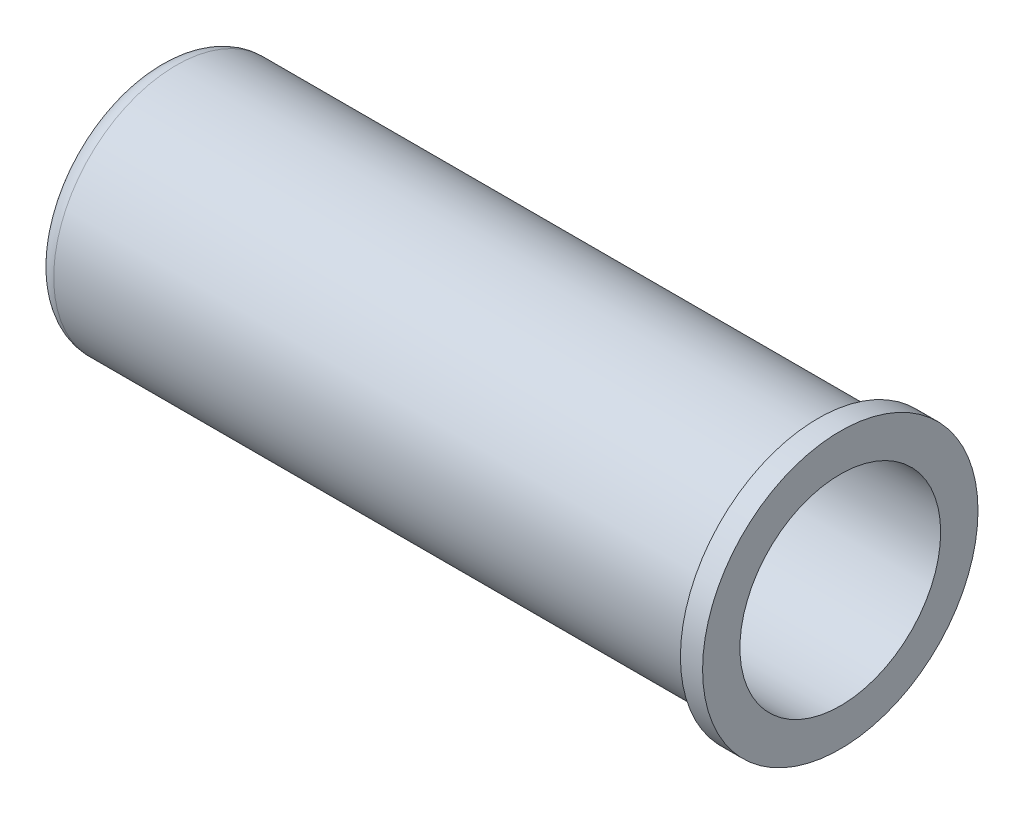
ISO-10303-21;
HEADER;
FILE_DESCRIPTION(('STEP AP214'),'2;1');
FILE_NAME('part.step','',(''),(''),'','','');
FILE_SCHEMA(('AUTOMOTIVE_DESIGN { 1 0 10303 214 1 1 1 1 }'));
ENDSEC;
DATA;
#1=APPLICATION_CONTEXT('core data for automotive mechanical design processes');
#2=APPLICATION_PROTOCOL_DEFINITION('international standard','automotive_design',2000,#1);
#3=PRODUCT_CONTEXT('',#1,'mechanical');
#4=PRODUCT('Part','Part','',(#3));
#5=PRODUCT_RELATED_PRODUCT_CATEGORY('part','',(#4));
#6=PRODUCT_DEFINITION_FORMATION('','',#4);
#7=PRODUCT_DEFINITION_CONTEXT('part definition',#1,'design');
#8=PRODUCT_DEFINITION('design','',#6,#7);
#9=PRODUCT_DEFINITION_SHAPE('','',#8);
#10=(LENGTH_UNIT() NAMED_UNIT(*) SI_UNIT(.MILLI.,.METRE.));
#11=(NAMED_UNIT(*) PLANE_ANGLE_UNIT() SI_UNIT($,.RADIAN.));
#12=(NAMED_UNIT(*) SI_UNIT($,.STERADIAN.) SOLID_ANGLE_UNIT());
#13=UNCERTAINTY_MEASURE_WITH_UNIT(LENGTH_MEASURE(1.E-05),#10,'distance_accuracy_value','');
#14=(GEOMETRIC_REPRESENTATION_CONTEXT(3) GLOBAL_UNCERTAINTY_ASSIGNED_CONTEXT((#13)) GLOBAL_UNIT_ASSIGNED_CONTEXT((#10,
#11,#12)) REPRESENTATION_CONTEXT('',''));
#15=CARTESIAN_POINT('',(0.,0.,0.));
#16=DIRECTION('',(0.,0.,1.));
#17=DIRECTION('',(1.,0.,0.));
#18=AXIS2_PLACEMENT_3D('',#15,#16,#17);
#19=CARTESIAN_POINT('',(0.,5.25,0.));
#20=DIRECTION('',(1.,0.,0.));
#21=DIRECTION('',(0.,0.,-1.));
#22=AXIS2_PLACEMENT_3D('',#19,#20,#21);
#23=PLANE('',#22);
#24=CARTESIAN_POINT('',(0.,0.,0.));
#25=DIRECTION('',(1.,0.,0.));
#26=DIRECTION('',(0.,0.,-1.));
#27=AXIS2_PLACEMENT_3D('',#24,#25,#26);
#28=CIRCLE('',#27,5.9);
#29=CARTESIAN_POINT('',(0.,0.,-5.9));
#30=VERTEX_POINT('',#29);
#31=EDGE_CURVE('E10',#30,#30,#28,.T.);
#32=ORIENTED_EDGE('',*,*,#31,.T.);
#33=EDGE_LOOP('',(#32));
#34=FACE_BOUND('',#33,.T.);
#35=CARTESIAN_POINT('',(0.,0.,0.));
#36=DIRECTION('',(1.,0.,0.));
#37=DIRECTION('',(0.,0.,-1.));
#38=AXIS2_PLACEMENT_3D('',#35,#36,#37);
#39=CIRCLE('',#38,4.3);
#40=CARTESIAN_POINT('',(0.,0.,-4.3));
#41=VERTEX_POINT('',#40);
#42=EDGE_CURVE('E73',#41,#41,#39,.T.);
#43=ORIENTED_EDGE('',*,*,#42,.F.);
#44=EDGE_LOOP('',(#43));
#45=FACE_BOUND('',#44,.T.);
#46=ADVANCED_FACE('F39',(#34,#45),#23,.T.);
#47=CARTESIAN_POINT('',(0.,0.,0.));
#48=DIRECTION('',(1.,0.,0.));
#49=DIRECTION('',(0.,0.,-1.));
#50=AXIS2_PLACEMENT_3D('',#47,#48,#49);
#51=CYLINDRICAL_SURFACE('',#50,5.9);
#52=CARTESIAN_POINT('',(-0.95,0.,0.));
#53=DIRECTION('',(1.,0.,0.));
#54=DIRECTION('',(0.,0.,-1.));
#55=AXIS2_PLACEMENT_3D('',#52,#53,#54);
#56=CIRCLE('',#55,5.9);
#57=CARTESIAN_POINT('',(-0.95,0.,-5.9));
#58=VERTEX_POINT('',#57);
#59=EDGE_CURVE('E45',#58,#58,#56,.T.);
#60=ORIENTED_EDGE('',*,*,#59,.T.);
#61=EDGE_LOOP('',(#60));
#62=FACE_BOUND('',#61,.T.);
#63=ORIENTED_EDGE('',*,*,#31,.F.);
#64=EDGE_LOOP('',(#63));
#65=FACE_BOUND('',#64,.T.);
#66=ADVANCED_FACE('F81',(#62,#65),#51,.T.);
#67=CARTESIAN_POINT('',(-0.95,5.9,0.));
#68=DIRECTION('',(-1.,0.,0.));
#69=DIRECTION('',(0.,0.,1.));
#70=AXIS2_PLACEMENT_3D('',#67,#68,#69);
#71=PLANE('',#70);
#72=CARTESIAN_POINT('',(-0.95,0.,0.));
#73=DIRECTION('',(1.,0.,0.));
#74=DIRECTION('',(0.,0.,-1.));
#75=AXIS2_PLACEMENT_3D('',#72,#73,#74);
#76=CIRCLE('',#75,5.25);
#77=CARTESIAN_POINT('',(-0.95,0.,-5.25));
#78=VERTEX_POINT('',#77);
#79=EDGE_CURVE('E49',#78,#78,#76,.T.);
#80=ORIENTED_EDGE('',*,*,#79,.T.);
#81=EDGE_LOOP('',(#80));
#82=FACE_BOUND('',#81,.T.);
#83=ORIENTED_EDGE('',*,*,#59,.F.);
#84=EDGE_LOOP('',(#83));
#85=FACE_BOUND('',#84,.T.);
#86=ADVANCED_FACE('F85',(#82,#85),#71,.T.);
#87=CARTESIAN_POINT('',(0.,0.,0.));
#88=DIRECTION('',(1.,0.,0.));
#89=DIRECTION('',(0.,0.,-1.));
#90=AXIS2_PLACEMENT_3D('',#87,#88,#89);
#91=CYLINDRICAL_SURFACE('',#90,5.25);
#92=CARTESIAN_POINT('',(-28.45,0.,0.));
#93=DIRECTION('',(1.,0.,0.));
#94=DIRECTION('',(0.,0.,-1.));
#95=AXIS2_PLACEMENT_3D('',#92,#93,#94);
#96=CIRCLE('',#95,5.25);
#97=CARTESIAN_POINT('',(-28.45,0.,-5.25));
#98=VERTEX_POINT('',#97);
#99=EDGE_CURVE('E53',#98,#98,#96,.T.);
#100=ORIENTED_EDGE('',*,*,#99,.T.);
#101=EDGE_LOOP('',(#100));
#102=FACE_BOUND('',#101,.T.);
#103=ORIENTED_EDGE('',*,*,#79,.F.);
#104=EDGE_LOOP('',(#103));
#105=FACE_BOUND('',#104,.T.);
#106=ADVANCED_FACE('F89',(#102,#105),#91,.T.);
#107=CARTESIAN_POINT('',(-28.45,0.,0.));
#108=DIRECTION('',(1.,0.,0.));
#109=DIRECTION('',(0.,0.,-1.));
#110=AXIS2_PLACEMENT_3D('',#107,#108,#109);
#111=TOROIDAL_SURFACE('',#110,4.45,0.8);
#112=CARTESIAN_POINT('',(-29.25,0.,0.));
#113=DIRECTION('',(1.,0.,0.));
#114=DIRECTION('',(0.,0.,-1.));
#115=AXIS2_PLACEMENT_3D('',#112,#113,#114);
#116=CIRCLE('',#115,4.45);
#117=CARTESIAN_POINT('',(-29.25,0.,-4.45));
#118=VERTEX_POINT('',#117);
#119=EDGE_CURVE('E58',#118,#118,#116,.T.);
#120=ORIENTED_EDGE('',*,*,#119,.T.);
#121=EDGE_LOOP('',(#120));
#122=FACE_BOUND('',#121,.T.);
#123=ORIENTED_EDGE('',*,*,#99,.F.);
#124=EDGE_LOOP('',(#123));
#125=FACE_BOUND('',#124,.T.);
#126=ADVANCED_FACE('F96',(#122,#125),#111,.T.);
#127=CARTESIAN_POINT('',(-29.25,3.35,0.));
#128=DIRECTION('',(-1.,0.,0.));
#129=DIRECTION('',(0.,0.,1.));
#130=AXIS2_PLACEMENT_3D('',#127,#128,#129);
#131=PLANE('',#130);
#132=CARTESIAN_POINT('',(-29.25,0.,0.));
#133=DIRECTION('',(1.,0.,0.));
#134=DIRECTION('',(0.,0.,-1.));
#135=AXIS2_PLACEMENT_3D('',#132,#133,#134);
#136=CIRCLE('',#135,3.35);
#137=CARTESIAN_POINT('',(-29.25,0.,-3.35));
#138=VERTEX_POINT('',#137);
#139=EDGE_CURVE('E61',#138,#138,#136,.T.);
#140=ORIENTED_EDGE('',*,*,#139,.T.);
#141=EDGE_LOOP('',(#140));
#142=FACE_BOUND('',#141,.T.);
#143=ORIENTED_EDGE('',*,*,#119,.F.);
#144=EDGE_LOOP('',(#143));
#145=FACE_BOUND('',#144,.T.);
#146=ADVANCED_FACE('F100',(#142,#145),#131,.T.);
#147=CARTESIAN_POINT('',(0.,0.,0.));
#148=DIRECTION('',(1.,0.,0.));
#149=DIRECTION('',(0.,0.,-1.));
#150=AXIS2_PLACEMENT_3D('',#147,#148,#149);
#151=CYLINDRICAL_SURFACE('',#150,3.35);
#152=CARTESIAN_POINT('',(-28.3,0.,0.));
#153=DIRECTION('',(1.,0.,0.));
#154=DIRECTION('',(0.,0.,-1.));
#155=AXIS2_PLACEMENT_3D('',#152,#153,#154);
#156=CIRCLE('',#155,3.35);
#157=CARTESIAN_POINT('',(-28.3,0.,-3.35));
#158=VERTEX_POINT('',#157);
#159=EDGE_CURVE('E64',#158,#158,#156,.T.);
#160=ORIENTED_EDGE('',*,*,#159,.T.);
#161=EDGE_LOOP('',(#160));
#162=FACE_BOUND('',#161,.T.);
#163=ORIENTED_EDGE('',*,*,#139,.F.);
#164=EDGE_LOOP('',(#163));
#165=FACE_BOUND('',#164,.T.);
#166=ADVANCED_FACE('F104',(#162,#165),#151,.F.);
#167=CARTESIAN_POINT('',(-28.3,3.5,0.));
#168=DIRECTION('',(1.,0.,0.));
#169=DIRECTION('',(0.,0.,-1.));
#170=AXIS2_PLACEMENT_3D('',#167,#168,#169);
#171=PLANE('',#170);
#172=CARTESIAN_POINT('',(-28.3,0.,0.));
#173=DIRECTION('',(1.,0.,0.));
#174=DIRECTION('',(0.,0.,-1.));
#175=AXIS2_PLACEMENT_3D('',#172,#173,#174);
#176=CIRCLE('',#175,3.5);
#177=CARTESIAN_POINT('',(-28.3,0.,-3.5));
#178=VERTEX_POINT('',#177);
#179=EDGE_CURVE('E67',#178,#178,#176,.T.);
#180=ORIENTED_EDGE('',*,*,#179,.T.);
#181=EDGE_LOOP('',(#180));
#182=FACE_BOUND('',#181,.T.);
#183=ORIENTED_EDGE('',*,*,#159,.F.);
#184=EDGE_LOOP('',(#183));
#185=FACE_BOUND('',#184,.T.);
#186=ADVANCED_FACE('F108',(#182,#185),#171,.T.);
#187=CARTESIAN_POINT('',(-27.5,0.,0.));
#188=DIRECTION('',(1.,0.,0.));
#189=DIRECTION('',(0.,0.,-1.));
#190=AXIS2_PLACEMENT_3D('',#187,#188,#189);
#191=TOROIDAL_SURFACE('',#190,3.5,0.799999999999999);
#192=CARTESIAN_POINT('',(-27.5,0.,0.));
#193=DIRECTION('',(1.,0.,0.));
#194=DIRECTION('',(0.,0.,-1.));
#195=AXIS2_PLACEMENT_3D('',#192,#193,#194);
#196=CIRCLE('',#195,4.3);
#197=CARTESIAN_POINT('',(-27.5,0.,-4.3));
#198=VERTEX_POINT('',#197);
#199=EDGE_CURVE('E70',#198,#198,#196,.T.);
#200=ORIENTED_EDGE('',*,*,#199,.T.);
#201=EDGE_LOOP('',(#200));
#202=FACE_BOUND('',#201,.T.);
#203=ORIENTED_EDGE('',*,*,#179,.F.);
#204=EDGE_LOOP('',(#203));
#205=FACE_BOUND('',#204,.T.);
#206=ADVANCED_FACE('F112',(#202,#205),#191,.F.);
#207=CARTESIAN_POINT('',(0.,0.,0.));
#208=DIRECTION('',(1.,0.,0.));
#209=DIRECTION('',(0.,0.,-1.));
#210=AXIS2_PLACEMENT_3D('',#207,#208,#209);
#211=CYLINDRICAL_SURFACE('',#210,4.3);
#212=ORIENTED_EDGE('',*,*,#42,.T.);
#213=EDGE_LOOP('',(#212));
#214=FACE_BOUND('',#213,.T.);
#215=ORIENTED_EDGE('',*,*,#199,.F.);
#216=EDGE_LOOP('',(#215));
#217=FACE_BOUND('',#216,.T.);
#218=ADVANCED_FACE('F77',(#214,#217),#211,.F.);
#219=CLOSED_SHELL('',(#46,#66,#86,#106,#126,#146,#166,#186,#206,#218));
#220=MANIFOLD_SOLID_BREP('B2',#219);
#221=ADVANCED_BREP_SHAPE_REPRESENTATION('',(#18,#220),#14);
#222=SHAPE_DEFINITION_REPRESENTATION(#9,#221);
ENDSEC;
END-ISO-10303-21;
